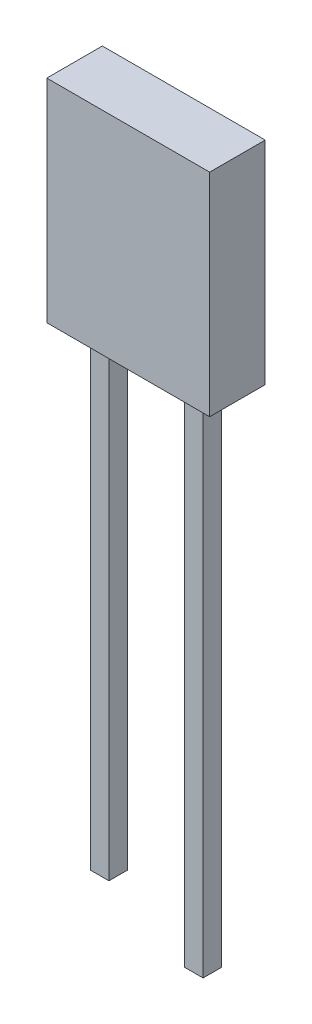
ISO-10303-21;
HEADER;
FILE_DESCRIPTION(('STEP AP214'),'2;1');
FILE_NAME('part.step','',(''),(''),'','','');
FILE_SCHEMA(('AUTOMOTIVE_DESIGN { 1 0 10303 214 1 1 1 1 }'));
ENDSEC;
DATA;
#1=APPLICATION_CONTEXT('core data for automotive mechanical design processes');
#2=APPLICATION_PROTOCOL_DEFINITION('international standard','automotive_design',2000,#1);
#3=PRODUCT_CONTEXT('',#1,'mechanical');
#4=PRODUCT('Part','Part','',(#3));
#5=PRODUCT_RELATED_PRODUCT_CATEGORY('part','',(#4));
#6=PRODUCT_DEFINITION_FORMATION('','',#4);
#7=PRODUCT_DEFINITION_CONTEXT('part definition',#1,'design');
#8=PRODUCT_DEFINITION('design','',#6,#7);
#9=PRODUCT_DEFINITION_SHAPE('','',#8);
#10=(LENGTH_UNIT() NAMED_UNIT(*) SI_UNIT(.MILLI.,.METRE.));
#11=(NAMED_UNIT(*) PLANE_ANGLE_UNIT() SI_UNIT($,.RADIAN.));
#12=(NAMED_UNIT(*) SI_UNIT($,.STERADIAN.) SOLID_ANGLE_UNIT());
#13=UNCERTAINTY_MEASURE_WITH_UNIT(LENGTH_MEASURE(1.E-05),#10,'distance_accuracy_value','');
#14=(GEOMETRIC_REPRESENTATION_CONTEXT(3) GLOBAL_UNCERTAINTY_ASSIGNED_CONTEXT((#13)) GLOBAL_UNIT_ASSIGNED_CONTEXT((#10,
#11,#12)) REPRESENTATION_CONTEXT('',''));
#15=CARTESIAN_POINT('',(0.,0.,0.));
#16=DIRECTION('',(0.,0.,1.));
#17=DIRECTION('',(1.,0.,0.));
#18=AXIS2_PLACEMENT_3D('',#15,#16,#17);
#19=CARTESIAN_POINT('',(2.19709999999999,-2.8575,-0.7493));
#20=DIRECTION('',(0.,0.,-1.));
#21=DIRECTION('',(1.,0.,0.));
#22=AXIS2_PLACEMENT_3D('',#19,#20,#21);
#23=PLANE('',#22);
#24=DIRECTION('',(0.,1.,0.));
#25=VECTOR('',#24,1.);
#26=CARTESIAN_POINT('',(2.19709999999999,2.8575,-0.7493));
#27=LINE('',#26,#25);
#28=CARTESIAN_POINT('',(2.19709999999999,-2.8575,-0.7493));
#29=VERTEX_POINT('',#28);
#30=CARTESIAN_POINT('',(2.19709999999999,2.8575,-0.7493));
#31=VERTEX_POINT('',#30);
#32=EDGE_CURVE('E195',#29,#31,#27,.T.);
#33=ORIENTED_EDGE('',*,*,#32,.F.);
#34=DIRECTION('',(1.,0.,0.));
#35=VECTOR('',#34,1.);
#36=CARTESIAN_POINT('',(-2.1971,-2.8575,-0.7493));
#37=LINE('',#36,#35);
#38=CARTESIAN_POINT('',(-2.1971,-2.8575,-0.7493));
#39=VERTEX_POINT('',#38);
#40=EDGE_CURVE('E200',#39,#29,#37,.T.);
#41=ORIENTED_EDGE('',*,*,#40,.F.);
#42=DIRECTION('',(0.,-1.,0.));
#43=VECTOR('',#42,1.);
#44=CARTESIAN_POINT('',(-2.19710000000001,2.8575,-0.7493));
#45=LINE('',#44,#43);
#46=CARTESIAN_POINT('',(-2.19710000000001,2.8575,-0.7493));
#47=VERTEX_POINT('',#46);
#48=EDGE_CURVE('E211',#47,#39,#45,.T.);
#49=ORIENTED_EDGE('',*,*,#48,.F.);
#50=DIRECTION('',(-1.,0.,0.));
#51=VECTOR('',#50,1.);
#52=CARTESIAN_POINT('',(-2.19710000000001,2.8575,-0.7493));
#53=LINE('',#52,#51);
#54=EDGE_CURVE('E208',#31,#47,#53,.T.);
#55=ORIENTED_EDGE('',*,*,#54,.F.);
#56=EDGE_LOOP('',(#33,#41,#49,#55));
#57=FACE_BOUND('',#56,.T.);
#58=CARTESIAN_POINT('',(0.,1.6375,-0.7493));
#59=DIRECTION('',(0.,0.,1.));
#60=DIRECTION('',(1.,0.,0.));
#61=AXIS2_PLACEMENT_3D('',#58,#59,#60);
#62=CIRCLE('',#61,0.75);
#63=CARTESIAN_POINT('',(0.75,1.6375,-0.7493));
#64=VERTEX_POINT('',#63);
#65=EDGE_CURVE('E192',#64,#64,#62,.T.);
#66=ORIENTED_EDGE('',*,*,#65,.T.);
#67=EDGE_LOOP('',(#66));
#68=FACE_BOUND('',#67,.T.);
#69=ADVANCED_FACE('F32',(#57,#68),#23,.T.);
#70=CARTESIAN_POINT('',(2.19709999999999,2.8575,0.7493));
#71=DIRECTION('',(1.,0.,0.));
#72=DIRECTION('',(0.,1.,0.));
#73=AXIS2_PLACEMENT_3D('',#70,#71,#72);
#74=PLANE('',#73);
#75=ORIENTED_EDGE('',*,*,#32,.T.);
#76=DIRECTION('',(0.,0.,-1.));
#77=VECTOR('',#76,1.);
#78=CARTESIAN_POINT('',(2.19709999999999,2.8575,0.7493));
#79=LINE('',#78,#77);
#80=CARTESIAN_POINT('',(2.19709999999999,2.8575,0.7493));
#81=VERTEX_POINT('',#80);
#82=EDGE_CURVE('E36',#81,#31,#79,.T.);
#83=ORIENTED_EDGE('',*,*,#82,.F.);
#84=DIRECTION('',(0.,1.,0.));
#85=VECTOR('',#84,1.);
#86=CARTESIAN_POINT('',(2.19709999999999,2.8575,0.7493));
#87=LINE('',#86,#85);
#88=CARTESIAN_POINT('',(2.19709999999999,-2.8575,0.7493));
#89=VERTEX_POINT('',#88);
#90=EDGE_CURVE('E196',#89,#81,#87,.T.);
#91=ORIENTED_EDGE('',*,*,#90,.F.);
#92=DIRECTION('',(0.,0.,-1.));
#93=VECTOR('',#92,1.);
#94=CARTESIAN_POINT('',(2.19709999999999,-2.8575,0.7493));
#95=LINE('',#94,#93);
#96=EDGE_CURVE('E11',#89,#29,#95,.T.);
#97=ORIENTED_EDGE('',*,*,#96,.T.);
#98=EDGE_LOOP('',(#75,#83,#91,#97));
#99=FACE_BOUND('',#98,.T.);
#100=ADVANCED_FACE('F34',(#99),#74,.T.);
#101=CARTESIAN_POINT('',(-2.1971,-2.8575,0.7493));
#102=DIRECTION('',(0.,-1.,0.));
#103=DIRECTION('',(0.,0.,1.));
#104=AXIS2_PLACEMENT_3D('',#101,#102,#103);
#105=PLANE('',#104);
#106=DIRECTION('',(-1.,0.,0.));
#107=VECTOR('',#106,1.);
#108=CARTESIAN_POINT('',(1.02,-2.8575,-0.25));
#109=LINE('',#108,#107);
#110=CARTESIAN_POINT('',(1.52,-2.8575,-0.25));
#111=VERTEX_POINT('',#110);
#112=CARTESIAN_POINT('',(1.02,-2.8575,-0.25));
#113=VERTEX_POINT('',#112);
#114=EDGE_CURVE('E152',#111,#113,#109,.T.);
#115=ORIENTED_EDGE('',*,*,#114,.T.);
#116=DIRECTION('',(0.,0.,1.));
#117=VECTOR('',#116,1.);
#118=CARTESIAN_POINT('',(1.02,-2.8575,-0.25));
#119=LINE('',#118,#117);
#120=CARTESIAN_POINT('',(1.02,-2.8575,0.25));
#121=VERTEX_POINT('',#120);
#122=EDGE_CURVE('E144',#113,#121,#119,.T.);
#123=ORIENTED_EDGE('',*,*,#122,.T.);
#124=DIRECTION('',(-1.,0.,0.));
#125=VECTOR('',#124,1.);
#126=CARTESIAN_POINT('',(1.02,-2.8575,0.25));
#127=LINE('',#126,#125);
#128=CARTESIAN_POINT('',(1.52,-2.8575,0.25));
#129=VERTEX_POINT('',#128);
#130=EDGE_CURVE('E146',#129,#121,#127,.T.);
#131=ORIENTED_EDGE('',*,*,#130,.F.);
#132=DIRECTION('',(0.,0.,1.));
#133=VECTOR('',#132,1.);
#134=CARTESIAN_POINT('',(1.52,-2.8575,-0.25));
#135=LINE('',#134,#133);
#136=EDGE_CURVE('E158',#111,#129,#135,.T.);
#137=ORIENTED_EDGE('',*,*,#136,.F.);
#138=EDGE_LOOP('',(#115,#123,#131,#137));
#139=FACE_BOUND('',#138,.T.);
#140=DIRECTION('',(-1.,0.,0.));
#141=VECTOR('',#140,1.);
#142=CARTESIAN_POINT('',(-1.52,-2.8575,-0.25));
#143=LINE('',#142,#141);
#144=CARTESIAN_POINT('',(-1.02,-2.8575,-0.25));
#145=VERTEX_POINT('',#144);
#146=CARTESIAN_POINT('',(-1.52,-2.8575,-0.25));
#147=VERTEX_POINT('',#146);
#148=EDGE_CURVE('E171',#145,#147,#143,.T.);
#149=ORIENTED_EDGE('',*,*,#148,.T.);
#150=DIRECTION('',(0.,0.,1.));
#151=VECTOR('',#150,1.);
#152=CARTESIAN_POINT('',(-1.52,-2.8575,-0.25));
#153=LINE('',#152,#151);
#154=CARTESIAN_POINT('',(-1.52,-2.8575,0.25));
#155=VERTEX_POINT('',#154);
#156=EDGE_CURVE('E174',#147,#155,#153,.T.);
#157=ORIENTED_EDGE('',*,*,#156,.T.);
#158=DIRECTION('',(-1.,0.,0.));
#159=VECTOR('',#158,1.);
#160=CARTESIAN_POINT('',(-1.52,-2.8575,0.25));
#161=LINE('',#160,#159);
#162=CARTESIAN_POINT('',(-1.02,-2.8575,0.25));
#163=VERTEX_POINT('',#162);
#164=EDGE_CURVE('E166',#163,#155,#161,.T.);
#165=ORIENTED_EDGE('',*,*,#164,.F.);
#166=DIRECTION('',(0.,0.,1.));
#167=VECTOR('',#166,1.);
#168=CARTESIAN_POINT('',(-1.02,-2.8575,-0.25));
#169=LINE('',#168,#167);
#170=EDGE_CURVE('E184',#145,#163,#169,.T.);
#171=ORIENTED_EDGE('',*,*,#170,.F.);
#172=EDGE_LOOP('',(#149,#157,#165,#171));
#173=FACE_BOUND('',#172,.T.);
#174=ORIENTED_EDGE('',*,*,#40,.T.);
#175=ORIENTED_EDGE('',*,*,#96,.F.);
#176=DIRECTION('',(1.,0.,0.));
#177=VECTOR('',#176,1.);
#178=CARTESIAN_POINT('',(-2.1971,-2.8575,0.7493));
#179=LINE('',#178,#177);
#180=CARTESIAN_POINT('',(-2.1971,-2.8575,0.7493));
#181=VERTEX_POINT('',#180);
#182=EDGE_CURVE('E204',#181,#89,#179,.T.);
#183=ORIENTED_EDGE('',*,*,#182,.F.);
#184=DIRECTION('',(0.,0.,-1.));
#185=VECTOR('',#184,1.);
#186=CARTESIAN_POINT('',(-2.1971,-2.8575,0.7493));
#187=LINE('',#186,#185);
#188=EDGE_CURVE('E41',#181,#39,#187,.T.);
#189=ORIENTED_EDGE('',*,*,#188,.T.);
#190=EDGE_LOOP('',(#174,#175,#183,#189));
#191=FACE_BOUND('',#190,.T.);
#192=ADVANCED_FACE('F234',(#139,#173,#191),#105,.T.);
#193=CARTESIAN_POINT('',(-2.19710000000001,2.8575,0.7493));
#194=DIRECTION('',(-1.,0.,0.));
#195=DIRECTION('',(0.,-1.,0.));
#196=AXIS2_PLACEMENT_3D('',#193,#194,#195);
#197=PLANE('',#196);
#198=ORIENTED_EDGE('',*,*,#48,.T.);
#199=ORIENTED_EDGE('',*,*,#188,.F.);
#200=DIRECTION('',(0.,-1.,0.));
#201=VECTOR('',#200,1.);
#202=CARTESIAN_POINT('',(-2.19710000000001,2.8575,0.7493));
#203=LINE('',#202,#201);
#204=CARTESIAN_POINT('',(-2.19710000000001,2.8575,0.7493));
#205=VERTEX_POINT('',#204);
#206=EDGE_CURVE('E202',#205,#181,#203,.T.);
#207=ORIENTED_EDGE('',*,*,#206,.F.);
#208=DIRECTION('',(0.,0.,-1.));
#209=VECTOR('',#208,1.);
#210=CARTESIAN_POINT('',(-2.19710000000001,2.8575,0.7493));
#211=LINE('',#210,#209);
#212=EDGE_CURVE('E216',#205,#47,#211,.T.);
#213=ORIENTED_EDGE('',*,*,#212,.T.);
#214=EDGE_LOOP('',(#198,#199,#207,#213));
#215=FACE_BOUND('',#214,.T.);
#216=ADVANCED_FACE('F236',(#215),#197,.T.);
#217=CARTESIAN_POINT('',(-2.19710000000001,2.8575,0.7493));
#218=DIRECTION('',(0.,1.,0.));
#219=DIRECTION('',(0.,0.,-1.));
#220=AXIS2_PLACEMENT_3D('',#217,#218,#219);
#221=PLANE('',#220);
#222=ORIENTED_EDGE('',*,*,#54,.T.);
#223=ORIENTED_EDGE('',*,*,#212,.F.);
#224=DIRECTION('',(-1.,0.,0.));
#225=VECTOR('',#224,1.);
#226=CARTESIAN_POINT('',(-2.19710000000001,2.8575,0.7493));
#227=LINE('',#226,#225);
#228=EDGE_CURVE('E199',#81,#205,#227,.T.);
#229=ORIENTED_EDGE('',*,*,#228,.F.);
#230=ORIENTED_EDGE('',*,*,#82,.T.);
#231=EDGE_LOOP('',(#222,#223,#229,#230));
#232=FACE_BOUND('',#231,.T.);
#233=ADVANCED_FACE('F223',(#232),#221,.T.);
#234=CARTESIAN_POINT('',(2.19709999999999,-2.8575,0.7493));
#235=DIRECTION('',(0.,0.,-1.));
#236=DIRECTION('',(1.,0.,0.));
#237=AXIS2_PLACEMENT_3D('',#234,#235,#236);
#238=PLANE('',#237);
#239=ORIENTED_EDGE('',*,*,#90,.T.);
#240=ORIENTED_EDGE('',*,*,#228,.T.);
#241=ORIENTED_EDGE('',*,*,#206,.T.);
#242=ORIENTED_EDGE('',*,*,#182,.T.);
#243=EDGE_LOOP('',(#239,#240,#241,#242));
#244=FACE_BOUND('',#243,.T.);
#245=ADVANCED_FACE('F243',(#244),#238,.F.);
#246=CARTESIAN_POINT('',(0.,1.6375,-0.7493));
#247=DIRECTION('',(0.,0.,-1.));
#248=DIRECTION('',(0.,1.,0.));
#249=AXIS2_PLACEMENT_3D('',#246,#247,#248);
#250=SPHERICAL_SURFACE('',#249,0.75);
#251=ORIENTED_EDGE('',*,*,#65,.F.);
#252=EDGE_LOOP('',(#251));
#253=FACE_BOUND('',#252,.T.);
#254=ADVANCED_FACE('F254',(#253),#250,.T.);
#255=CARTESIAN_POINT('',(-1.52,-2.8575,-0.25));
#256=DIRECTION('',(1.,0.,0.));
#257=DIRECTION('',(0.,1.,0.));
#258=AXIS2_PLACEMENT_3D('',#255,#256,#257);
#259=PLANE('',#258);
#260=DIRECTION('',(0.,-1.,0.));
#261=VECTOR('',#260,1.);
#262=CARTESIAN_POINT('',(-1.52,-2.8575,0.25));
#263=LINE('',#262,#261);
#264=CARTESIAN_POINT('',(-1.52,-15.5575,0.25));
#265=VERTEX_POINT('',#264);
#266=EDGE_CURVE('E57',#155,#265,#263,.T.);
#267=ORIENTED_EDGE('',*,*,#266,.F.);
#268=ORIENTED_EDGE('',*,*,#156,.F.);
#269=DIRECTION('',(0.,-1.,0.));
#270=VECTOR('',#269,1.);
#271=CARTESIAN_POINT('',(-1.52,-2.8575,-0.25));
#272=LINE('',#271,#270);
#273=CARTESIAN_POINT('',(-1.52,-15.5575,-0.25));
#274=VERTEX_POINT('',#273);
#275=EDGE_CURVE('E162',#147,#274,#272,.T.);
#276=ORIENTED_EDGE('',*,*,#275,.T.);
#277=DIRECTION('',(0.,0.,1.));
#278=VECTOR('',#277,1.);
#279=CARTESIAN_POINT('',(-1.52,-15.5575,-0.25));
#280=LINE('',#279,#278);
#281=EDGE_CURVE('E190',#274,#265,#280,.T.);
#282=ORIENTED_EDGE('',*,*,#281,.T.);
#283=EDGE_LOOP('',(#267,#268,#276,#282));
#284=FACE_BOUND('',#283,.T.);
#285=ADVANCED_FACE('F258',(#284),#259,.F.);
#286=CARTESIAN_POINT('',(-1.52,-15.5575,-0.25));
#287=DIRECTION('',(0.,1.,0.));
#288=DIRECTION('',(0.,0.,-1.));
#289=AXIS2_PLACEMENT_3D('',#286,#287,#288);
#290=PLANE('',#289);
#291=DIRECTION('',(1.,0.,0.));
#292=VECTOR('',#291,1.);
#293=CARTESIAN_POINT('',(-1.52,-15.5575,0.25));
#294=LINE('',#293,#292);
#295=CARTESIAN_POINT('',(-1.02,-15.5575,0.25));
#296=VERTEX_POINT('',#295);
#297=EDGE_CURVE('E176',#265,#296,#294,.T.);
#298=ORIENTED_EDGE('',*,*,#297,.F.);
#299=ORIENTED_EDGE('',*,*,#281,.F.);
#300=DIRECTION('',(1.,0.,0.));
#301=VECTOR('',#300,1.);
#302=CARTESIAN_POINT('',(-1.52,-15.5575,-0.25));
#303=LINE('',#302,#301);
#304=CARTESIAN_POINT('',(-1.02,-15.5575,-0.25));
#305=VERTEX_POINT('',#304);
#306=EDGE_CURVE('E165',#274,#305,#303,.T.);
#307=ORIENTED_EDGE('',*,*,#306,.T.);
#308=DIRECTION('',(0.,0.,1.));
#309=VECTOR('',#308,1.);
#310=CARTESIAN_POINT('',(-1.02,-15.5575,-0.25));
#311=LINE('',#310,#309);
#312=EDGE_CURVE('E187',#305,#296,#311,.T.);
#313=ORIENTED_EDGE('',*,*,#312,.T.);
#314=EDGE_LOOP('',(#298,#299,#307,#313));
#315=FACE_BOUND('',#314,.T.);
#316=ADVANCED_FACE('F262',(#315),#290,.F.);
#317=CARTESIAN_POINT('',(-1.02,-2.8575,-0.25));
#318=DIRECTION('',(-1.,0.,0.));
#319=DIRECTION('',(0.,-1.,0.));
#320=AXIS2_PLACEMENT_3D('',#317,#318,#319);
#321=PLANE('',#320);
#322=DIRECTION('',(0.,1.,0.));
#323=VECTOR('',#322,1.);
#324=CARTESIAN_POINT('',(-1.02,-2.8575,0.25));
#325=LINE('',#324,#323);
#326=EDGE_CURVE('E179',#296,#163,#325,.T.);
#327=ORIENTED_EDGE('',*,*,#326,.F.);
#328=ORIENTED_EDGE('',*,*,#312,.F.);
#329=DIRECTION('',(0.,1.,0.));
#330=VECTOR('',#329,1.);
#331=CARTESIAN_POINT('',(-1.02,-2.8575,-0.25));
#332=LINE('',#331,#330);
#333=EDGE_CURVE('E169',#305,#145,#332,.T.);
#334=ORIENTED_EDGE('',*,*,#333,.T.);
#335=ORIENTED_EDGE('',*,*,#170,.T.);
#336=EDGE_LOOP('',(#327,#328,#334,#335));
#337=FACE_BOUND('',#336,.T.);
#338=ADVANCED_FACE('F265',(#337),#321,.F.);
#339=CARTESIAN_POINT('',(-1.52,-15.5575,-0.25));
#340=DIRECTION('',(0.,0.,-1.));
#341=DIRECTION('',(1.,0.,0.));
#342=AXIS2_PLACEMENT_3D('',#339,#340,#341);
#343=PLANE('',#342);
#344=ORIENTED_EDGE('',*,*,#275,.F.);
#345=ORIENTED_EDGE('',*,*,#148,.F.);
#346=ORIENTED_EDGE('',*,*,#333,.F.);
#347=ORIENTED_EDGE('',*,*,#306,.F.);
#348=EDGE_LOOP('',(#344,#345,#346,#347));
#349=FACE_BOUND('',#348,.T.);
#350=ADVANCED_FACE('F269',(#349),#343,.T.);
#351=CARTESIAN_POINT('',(-1.52,-15.5575,0.25));
#352=DIRECTION('',(0.,0.,-1.));
#353=DIRECTION('',(1.,0.,0.));
#354=AXIS2_PLACEMENT_3D('',#351,#352,#353);
#355=PLANE('',#354);
#356=ORIENTED_EDGE('',*,*,#266,.T.);
#357=ORIENTED_EDGE('',*,*,#297,.T.);
#358=ORIENTED_EDGE('',*,*,#326,.T.);
#359=ORIENTED_EDGE('',*,*,#164,.T.);
#360=EDGE_LOOP('',(#356,#357,#358,#359));
#361=FACE_BOUND('',#360,.T.);
#362=ADVANCED_FACE('F271',(#361),#355,.F.);
#363=CARTESIAN_POINT('',(1.02,-2.8575,-0.25));
#364=DIRECTION('',(1.,0.,0.));
#365=DIRECTION('',(0.,1.,0.));
#366=AXIS2_PLACEMENT_3D('',#363,#364,#365);
#367=PLANE('',#366);
#368=DIRECTION('',(0.,-1.,0.));
#369=VECTOR('',#368,1.);
#370=CARTESIAN_POINT('',(1.02,-2.8575,0.25));
#371=LINE('',#370,#369);
#372=CARTESIAN_POINT('',(1.02,-16.5575,0.25));
#373=VERTEX_POINT('',#372);
#374=EDGE_CURVE('E49',#121,#373,#371,.T.);
#375=ORIENTED_EDGE('',*,*,#374,.F.);
#376=ORIENTED_EDGE('',*,*,#122,.F.);
#377=DIRECTION('',(0.,-1.,0.));
#378=VECTOR('',#377,1.);
#379=CARTESIAN_POINT('',(1.02,-2.8575,-0.25));
#380=LINE('',#379,#378);
#381=CARTESIAN_POINT('',(1.02,-16.5575,-0.25));
#382=VERTEX_POINT('',#381);
#383=EDGE_CURVE('E130',#113,#382,#380,.T.);
#384=ORIENTED_EDGE('',*,*,#383,.T.);
#385=DIRECTION('',(0.,0.,1.));
#386=VECTOR('',#385,1.);
#387=CARTESIAN_POINT('',(1.02,-16.5575,-0.25));
#388=LINE('',#387,#386);
#389=EDGE_CURVE('E136',#382,#373,#388,.T.);
#390=ORIENTED_EDGE('',*,*,#389,.T.);
#391=EDGE_LOOP('',(#375,#376,#384,#390));
#392=FACE_BOUND('',#391,.T.);
#393=ADVANCED_FACE('F142',(#392),#367,.F.);
#394=CARTESIAN_POINT('',(1.02,-16.5575,-0.25));
#395=DIRECTION('',(0.,1.,0.));
#396=DIRECTION('',(0.,0.,-1.));
#397=AXIS2_PLACEMENT_3D('',#394,#395,#396);
#398=PLANE('',#397);
#399=DIRECTION('',(1.,0.,0.));
#400=VECTOR('',#399,1.);
#401=CARTESIAN_POINT('',(1.02,-16.5575,0.25));
#402=LINE('',#401,#400);
#403=CARTESIAN_POINT('',(1.52,-16.5575,0.25));
#404=VERTEX_POINT('',#403);
#405=EDGE_CURVE('E139',#373,#404,#402,.T.);
#406=ORIENTED_EDGE('',*,*,#405,.F.);
#407=ORIENTED_EDGE('',*,*,#389,.F.);
#408=DIRECTION('',(1.,0.,0.));
#409=VECTOR('',#408,1.);
#410=CARTESIAN_POINT('',(1.02,-16.5575,-0.25));
#411=LINE('',#410,#409);
#412=CARTESIAN_POINT('',(1.52,-16.5575,-0.25));
#413=VERTEX_POINT('',#412);
#414=EDGE_CURVE('E125',#382,#413,#411,.T.);
#415=ORIENTED_EDGE('',*,*,#414,.T.);
#416=DIRECTION('',(0.,0.,1.));
#417=VECTOR('',#416,1.);
#418=CARTESIAN_POINT('',(1.52,-16.5575,-0.25));
#419=LINE('',#418,#417);
#420=EDGE_CURVE('E140',#413,#404,#419,.T.);
#421=ORIENTED_EDGE('',*,*,#420,.T.);
#422=EDGE_LOOP('',(#406,#407,#415,#421));
#423=FACE_BOUND('',#422,.T.);
#424=ADVANCED_FACE('F137',(#423),#398,.F.);
#425=CARTESIAN_POINT('',(1.52,-2.8575,-0.25));
#426=DIRECTION('',(-1.,0.,0.));
#427=DIRECTION('',(0.,-1.,0.));
#428=AXIS2_PLACEMENT_3D('',#425,#426,#427);
#429=PLANE('',#428);
#430=DIRECTION('',(0.,1.,0.));
#431=VECTOR('',#430,1.);
#432=CARTESIAN_POINT('',(1.52,-2.8575,0.25));
#433=LINE('',#432,#431);
#434=EDGE_CURVE('E148',#404,#129,#433,.T.);
#435=ORIENTED_EDGE('',*,*,#434,.F.);
#436=ORIENTED_EDGE('',*,*,#420,.F.);
#437=DIRECTION('',(0.,1.,0.));
#438=VECTOR('',#437,1.);
#439=CARTESIAN_POINT('',(1.52,-2.8575,-0.25));
#440=LINE('',#439,#438);
#441=EDGE_CURVE('E131',#413,#111,#440,.T.);
#442=ORIENTED_EDGE('',*,*,#441,.T.);
#443=ORIENTED_EDGE('',*,*,#136,.T.);
#444=EDGE_LOOP('',(#435,#436,#442,#443));
#445=FACE_BOUND('',#444,.T.);
#446=ADVANCED_FACE('F282',(#445),#429,.F.);
#447=CARTESIAN_POINT('',(1.02,-16.5575,-0.25));
#448=DIRECTION('',(0.,0.,-1.));
#449=DIRECTION('',(1.,0.,0.));
#450=AXIS2_PLACEMENT_3D('',#447,#448,#449);
#451=PLANE('',#450);
#452=ORIENTED_EDGE('',*,*,#383,.F.);
#453=ORIENTED_EDGE('',*,*,#114,.F.);
#454=ORIENTED_EDGE('',*,*,#441,.F.);
#455=ORIENTED_EDGE('',*,*,#414,.F.);
#456=EDGE_LOOP('',(#452,#453,#454,#455));
#457=FACE_BOUND('',#456,.T.);
#458=ADVANCED_FACE('F127',(#457),#451,.T.);
#459=CARTESIAN_POINT('',(1.02,-16.5575,0.25));
#460=DIRECTION('',(0.,0.,-1.));
#461=DIRECTION('',(1.,0.,0.));
#462=AXIS2_PLACEMENT_3D('',#459,#460,#461);
#463=PLANE('',#462);
#464=ORIENTED_EDGE('',*,*,#374,.T.);
#465=ORIENTED_EDGE('',*,*,#405,.T.);
#466=ORIENTED_EDGE('',*,*,#434,.T.);
#467=ORIENTED_EDGE('',*,*,#130,.T.);
#468=EDGE_LOOP('',(#464,#465,#466,#467));
#469=FACE_BOUND('',#468,.T.);
#470=ADVANCED_FACE('F286',(#469),#463,.F.);
#471=CLOSED_SHELL('',(#69,#100,#192,#216,#233,#245,#254,#285,#316,#338,#350,#362,#393,#424,#446,
#458,#470));
#472=MANIFOLD_SOLID_BREP('B2',#471);
#473=ADVANCED_BREP_SHAPE_REPRESENTATION('',(#18,#472),#14);
#474=SHAPE_DEFINITION_REPRESENTATION(#9,#473);
ENDSEC;
END-ISO-10303-21;
